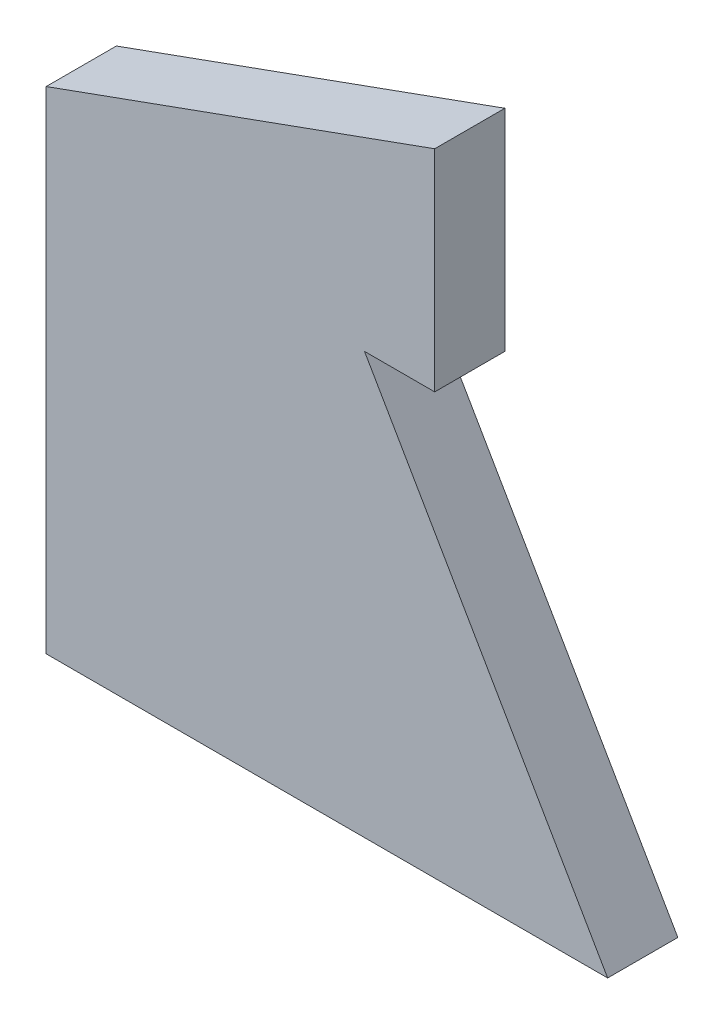
ISO-10303-21;
HEADER;
FILE_DESCRIPTION(('STEP AP214'),'2;1');
FILE_NAME('part.step','',(''),(''),'','','');
FILE_SCHEMA(('AUTOMOTIVE_DESIGN { 1 0 10303 214 1 1 1 1 }'));
ENDSEC;
DATA;
#1=APPLICATION_CONTEXT('core data for automotive mechanical design processes');
#2=APPLICATION_PROTOCOL_DEFINITION('international standard','automotive_design',2000,#1);
#3=PRODUCT_CONTEXT('',#1,'mechanical');
#4=PRODUCT('Part','Part','',(#3));
#5=PRODUCT_RELATED_PRODUCT_CATEGORY('part','',(#4));
#6=PRODUCT_DEFINITION_FORMATION('','',#4);
#7=PRODUCT_DEFINITION_CONTEXT('part definition',#1,'design');
#8=PRODUCT_DEFINITION('design','',#6,#7);
#9=PRODUCT_DEFINITION_SHAPE('','',#8);
#10=(LENGTH_UNIT() NAMED_UNIT(*) SI_UNIT(.MILLI.,.METRE.));
#11=(NAMED_UNIT(*) PLANE_ANGLE_UNIT() SI_UNIT($,.RADIAN.));
#12=(NAMED_UNIT(*) SI_UNIT($,.STERADIAN.) SOLID_ANGLE_UNIT());
#13=UNCERTAINTY_MEASURE_WITH_UNIT(LENGTH_MEASURE(1.E-05),#10,'distance_accuracy_value','');
#14=(GEOMETRIC_REPRESENTATION_CONTEXT(3) GLOBAL_UNCERTAINTY_ASSIGNED_CONTEXT((#13)) GLOBAL_UNIT_ASSIGNED_CONTEXT((#10,
#11,#12)) REPRESENTATION_CONTEXT('',''));
#15=CARTESIAN_POINT('',(0.,0.,0.));
#16=DIRECTION('',(0.,0.,1.));
#17=DIRECTION('',(1.,0.,0.));
#18=AXIS2_PLACEMENT_3D('',#15,#16,#17);
#19=CARTESIAN_POINT('',(0.,70.,10.));
#20=DIRECTION('',(1.,0.,0.));
#21=DIRECTION('',(0.,1.,0.));
#22=AXIS2_PLACEMENT_3D('',#19,#20,#21);
#23=PLANE('',#22);
#24=DIRECTION('',(0.,-1.,0.));
#25=VECTOR('',#24,1.);
#26=CARTESIAN_POINT('',(0.,70.,0.));
#27=LINE('',#26,#25);
#28=CARTESIAN_POINT('',(0.,70.,0.));
#29=VERTEX_POINT('',#28);
#30=CARTESIAN_POINT('',(0.,0.,0.));
#31=VERTEX_POINT('',#30);
#32=EDGE_CURVE('E119',#29,#31,#27,.T.);
#33=ORIENTED_EDGE('',*,*,#32,.T.);
#34=DIRECTION('',(0.,0.,-1.));
#35=VECTOR('',#34,1.);
#36=CARTESIAN_POINT('',(0.,0.,10.));
#37=LINE('',#36,#35);
#38=CARTESIAN_POINT('',(0.,0.,10.));
#39=VERTEX_POINT('',#38);
#40=EDGE_CURVE('E11',#39,#31,#37,.T.);
#41=ORIENTED_EDGE('',*,*,#40,.F.);
#42=DIRECTION('',(0.,-1.,0.));
#43=VECTOR('',#42,1.);
#44=CARTESIAN_POINT('',(0.,70.,10.));
#45=LINE('',#44,#43);
#46=CARTESIAN_POINT('',(0.,70.,10.));
#47=VERTEX_POINT('',#46);
#48=EDGE_CURVE('E129',#47,#39,#45,.T.);
#49=ORIENTED_EDGE('',*,*,#48,.F.);
#50=DIRECTION('',(0.,0.,-1.));
#51=VECTOR('',#50,1.);
#52=CARTESIAN_POINT('',(0.,70.,10.));
#53=LINE('',#52,#51);
#54=EDGE_CURVE('E115',#47,#29,#53,.T.);
#55=ORIENTED_EDGE('',*,*,#54,.T.);
#56=EDGE_LOOP('',(#33,#41,#49,#55));
#57=FACE_BOUND('',#56,.T.);
#58=ADVANCED_FACE('F35',(#57),#23,.F.);
#59=CARTESIAN_POINT('',(0.,0.,10.));
#60=DIRECTION('',(0.,1.,0.));
#61=DIRECTION('',(0.,0.,1.));
#62=AXIS2_PLACEMENT_3D('',#59,#60,#61);
#63=PLANE('',#62);
#64=DIRECTION('',(1.,0.,0.));
#65=VECTOR('',#64,1.);
#66=CARTESIAN_POINT('',(0.,0.,0.));
#67=LINE('',#66,#65);
#68=CARTESIAN_POINT('',(80.,0.,0.));
#69=VERTEX_POINT('',#68);
#70=EDGE_CURVE('E122',#31,#69,#67,.T.);
#71=ORIENTED_EDGE('',*,*,#70,.T.);
#72=DIRECTION('',(0.,0.,-1.));
#73=VECTOR('',#72,1.);
#74=CARTESIAN_POINT('',(80.,0.,10.));
#75=LINE('',#74,#73);
#76=CARTESIAN_POINT('',(80.,0.,10.));
#77=VERTEX_POINT('',#76);
#78=EDGE_CURVE('E43',#77,#69,#75,.T.);
#79=ORIENTED_EDGE('',*,*,#78,.F.);
#80=DIRECTION('',(1.,0.,0.));
#81=VECTOR('',#80,1.);
#82=CARTESIAN_POINT('',(0.,0.,10.));
#83=LINE('',#82,#81);
#84=EDGE_CURVE('E88',#39,#77,#83,.T.);
#85=ORIENTED_EDGE('',*,*,#84,.F.);
#86=ORIENTED_EDGE('',*,*,#40,.T.);
#87=EDGE_LOOP('',(#71,#79,#85,#86));
#88=FACE_BOUND('',#87,.T.);
#89=ADVANCED_FACE('F153',(#88),#63,.F.);
#90=CARTESIAN_POINT('',(80.,0.,10.));
#91=DIRECTION('',(-0.866025403784436,-0.500000000000004,0.));
#92=DIRECTION('',(0.500000000000004,-0.866025403784436,0.));
#93=AXIS2_PLACEMENT_3D('',#90,#91,#92);
#94=PLANE('',#93);
#95=DIRECTION('',(-0.500000000000004,0.866025403784436,0.));
#96=VECTOR('',#95,1.);
#97=CARTESIAN_POINT('',(80.,0.,0.));
#98=LINE('',#97,#96);
#99=CARTESIAN_POINT('',(45.3589838486221,60.,0.));
#100=VERTEX_POINT('',#99);
#101=EDGE_CURVE('E124',#69,#100,#98,.T.);
#102=ORIENTED_EDGE('',*,*,#101,.T.);
#103=DIRECTION('',(0.,0.,-1.));
#104=VECTOR('',#103,1.);
#105=CARTESIAN_POINT('',(45.3589838486221,60.,10.));
#106=LINE('',#105,#104);
#107=CARTESIAN_POINT('',(45.3589838486221,60.,10.));
#108=VERTEX_POINT('',#107);
#109=EDGE_CURVE('E110',#108,#100,#106,.T.);
#110=ORIENTED_EDGE('',*,*,#109,.F.);
#111=DIRECTION('',(-0.500000000000004,0.866025403784436,0.));
#112=VECTOR('',#111,1.);
#113=CARTESIAN_POINT('',(80.,0.,10.));
#114=LINE('',#113,#112);
#115=EDGE_CURVE('E101',#77,#108,#114,.T.);
#116=ORIENTED_EDGE('',*,*,#115,.F.);
#117=ORIENTED_EDGE('',*,*,#78,.T.);
#118=EDGE_LOOP('',(#102,#110,#116,#117));
#119=FACE_BOUND('',#118,.T.);
#120=ADVANCED_FACE('F135',(#119),#94,.F.);
#121=CARTESIAN_POINT('',(45.3589838486221,60.,10.));
#122=DIRECTION('',(0.,1.,0.));
#123=DIRECTION('',(-1.,0.,0.));
#124=AXIS2_PLACEMENT_3D('',#121,#122,#123);
#125=PLANE('',#124);
#126=DIRECTION('',(1.,0.,0.));
#127=VECTOR('',#126,1.);
#128=CARTESIAN_POINT('',(45.3589838486221,60.,0.));
#129=LINE('',#128,#127);
#130=CARTESIAN_POINT('',(55.3589838486221,60.,0.));
#131=VERTEX_POINT('',#130);
#132=EDGE_CURVE('E109',#100,#131,#129,.T.);
#133=ORIENTED_EDGE('',*,*,#132,.T.);
#134=DIRECTION('',(0.,0.,-1.));
#135=VECTOR('',#134,1.);
#136=CARTESIAN_POINT('',(55.3589838486221,60.,10.));
#137=LINE('',#136,#135);
#138=CARTESIAN_POINT('',(55.3589838486221,60.,10.));
#139=VERTEX_POINT('',#138);
#140=EDGE_CURVE('E106',#139,#131,#137,.T.);
#141=ORIENTED_EDGE('',*,*,#140,.F.);
#142=DIRECTION('',(1.,0.,0.));
#143=VECTOR('',#142,1.);
#144=CARTESIAN_POINT('',(45.3589838486221,60.,10.));
#145=LINE('',#144,#143);
#146=EDGE_CURVE('E95',#108,#139,#145,.T.);
#147=ORIENTED_EDGE('',*,*,#146,.F.);
#148=ORIENTED_EDGE('',*,*,#109,.T.);
#149=EDGE_LOOP('',(#133,#141,#147,#148));
#150=FACE_BOUND('',#149,.T.);
#151=ADVANCED_FACE('F107',(#150),#125,.F.);
#152=CARTESIAN_POINT('',(55.3589838486221,60.,10.));
#153=DIRECTION('',(-1.,0.,0.));
#154=DIRECTION('',(0.,0.,1.));
#155=AXIS2_PLACEMENT_3D('',#152,#153,#154);
#156=PLANE('',#155);
#157=DIRECTION('',(0.,1.,0.));
#158=VECTOR('',#157,1.);
#159=CARTESIAN_POINT('',(55.3589838486221,60.,0.));
#160=LINE('',#159,#158);
#161=CARTESIAN_POINT('',(55.3589838486221,90.,0.));
#162=VERTEX_POINT('',#161);
#163=EDGE_CURVE('E74',#131,#162,#160,.T.);
#164=ORIENTED_EDGE('',*,*,#163,.T.);
#165=DIRECTION('',(0.,0.,-1.));
#166=VECTOR('',#165,1.);
#167=CARTESIAN_POINT('',(55.3589838486221,90.,10.));
#168=LINE('',#167,#166);
#169=CARTESIAN_POINT('',(55.3589838486221,90.,10.));
#170=VERTEX_POINT('',#169);
#171=EDGE_CURVE('E111',#170,#162,#168,.T.);
#172=ORIENTED_EDGE('',*,*,#171,.F.);
#173=DIRECTION('',(0.,1.,0.));
#174=VECTOR('',#173,1.);
#175=CARTESIAN_POINT('',(55.3589838486221,60.,10.));
#176=LINE('',#175,#174);
#177=EDGE_CURVE('E99',#139,#170,#176,.T.);
#178=ORIENTED_EDGE('',*,*,#177,.F.);
#179=ORIENTED_EDGE('',*,*,#140,.T.);
#180=EDGE_LOOP('',(#164,#172,#178,#179));
#181=FACE_BOUND('',#180,.T.);
#182=ADVANCED_FACE('F113',(#181),#156,.F.);
#183=CARTESIAN_POINT('',(55.3589838486221,90.,10.));
#184=DIRECTION('',(0.339783569066057,-0.940503655597751,0.));
#185=DIRECTION('',(0.940503655597751,0.339783569066057,0.));
#186=AXIS2_PLACEMENT_3D('',#183,#184,#185);
#187=PLANE('',#186);
#188=DIRECTION('',(-0.94050365559775,-0.339783569066057,0.));
#189=VECTOR('',#188,1.);
#190=CARTESIAN_POINT('',(55.3589838486221,90.,0.));
#191=LINE('',#190,#189);
#192=EDGE_CURVE('E80',#162,#29,#191,.T.);
#193=ORIENTED_EDGE('',*,*,#192,.T.);
#194=ORIENTED_EDGE('',*,*,#54,.F.);
#195=DIRECTION('',(-0.94050365559775,-0.339783569066057,0.));
#196=VECTOR('',#195,1.);
#197=CARTESIAN_POINT('',(55.3589838486221,90.,10.));
#198=LINE('',#197,#196);
#199=EDGE_CURVE('E51',#170,#47,#198,.T.);
#200=ORIENTED_EDGE('',*,*,#199,.F.);
#201=ORIENTED_EDGE('',*,*,#171,.T.);
#202=EDGE_LOOP('',(#193,#194,#200,#201));
#203=FACE_BOUND('',#202,.T.);
#204=ADVANCED_FACE('F142',(#203),#187,.F.);
#205=CARTESIAN_POINT('',(0.,0.,10.));
#206=DIRECTION('',(0.,0.,1.));
#207=DIRECTION('',(1.,0.,0.));
#208=AXIS2_PLACEMENT_3D('',#205,#206,#207);
#209=PLANE('',#208);
#210=ORIENTED_EDGE('',*,*,#48,.T.);
#211=ORIENTED_EDGE('',*,*,#84,.T.);
#212=ORIENTED_EDGE('',*,*,#115,.T.);
#213=ORIENTED_EDGE('',*,*,#146,.T.);
#214=ORIENTED_EDGE('',*,*,#177,.T.);
#215=ORIENTED_EDGE('',*,*,#199,.T.);
#216=EDGE_LOOP('',(#210,#211,#212,#213,#214,#215));
#217=FACE_BOUND('',#216,.T.);
#218=ADVANCED_FACE('F97',(#217),#209,.T.);
#219=CARTESIAN_POINT('',(0.,0.,0.));
#220=DIRECTION('',(0.,0.,1.));
#221=DIRECTION('',(1.,0.,0.));
#222=AXIS2_PLACEMENT_3D('',#219,#220,#221);
#223=PLANE('',#222);
#224=ORIENTED_EDGE('',*,*,#32,.F.);
#225=ORIENTED_EDGE('',*,*,#192,.F.);
#226=ORIENTED_EDGE('',*,*,#163,.F.);
#227=ORIENTED_EDGE('',*,*,#132,.F.);
#228=ORIENTED_EDGE('',*,*,#101,.F.);
#229=ORIENTED_EDGE('',*,*,#70,.F.);
#230=EDGE_LOOP('',(#224,#225,#226,#227,#228,#229));
#231=FACE_BOUND('',#230,.T.);
#232=ADVANCED_FACE('F138',(#231),#223,.F.);
#233=CLOSED_SHELL('',(#58,#89,#120,#151,#182,#204,#218,#232));
#234=MANIFOLD_SOLID_BREP('B2',#233);
#235=ADVANCED_BREP_SHAPE_REPRESENTATION('',(#18,#234),#14);
#236=SHAPE_DEFINITION_REPRESENTATION(#9,#235);
ENDSEC;
END-ISO-10303-21;
